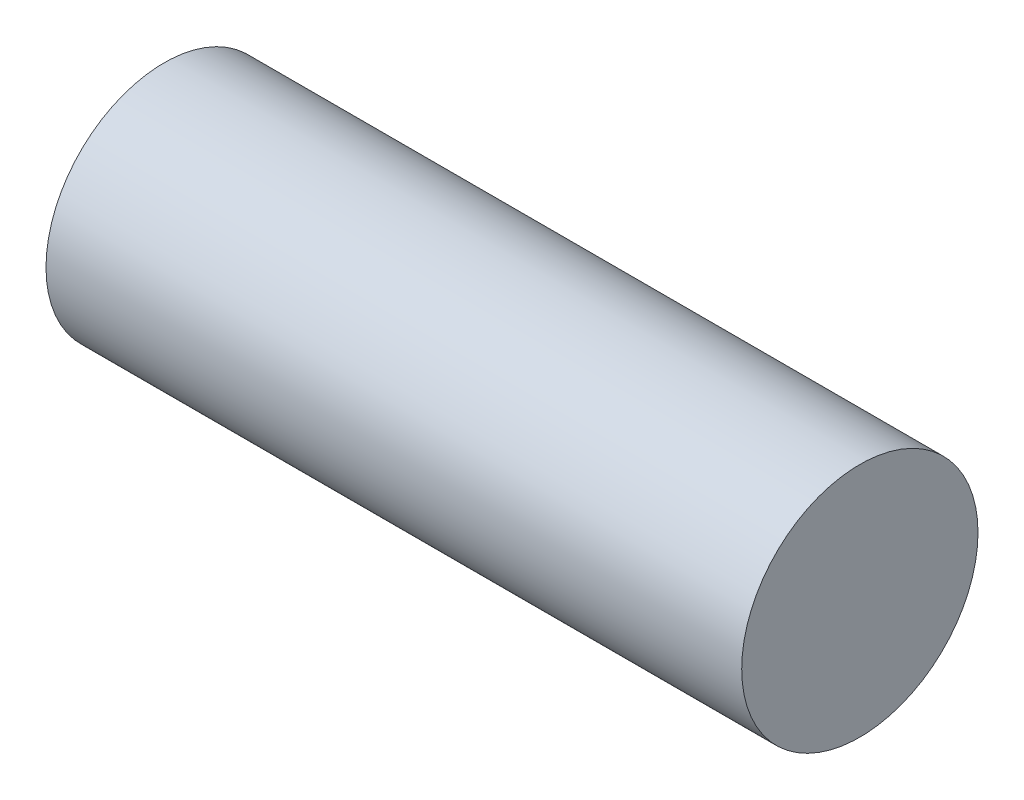
ISO-10303-21;
HEADER;
FILE_DESCRIPTION(('STEP AP214'),'2;1');
FILE_NAME('part.step','',(''),(''),'','','');
FILE_SCHEMA(('AUTOMOTIVE_DESIGN { 1 0 10303 214 1 1 1 1 }'));
ENDSEC;
DATA;
#1=APPLICATION_CONTEXT('core data for automotive mechanical design processes');
#2=APPLICATION_PROTOCOL_DEFINITION('international standard','automotive_design',2000,#1);
#3=PRODUCT_CONTEXT('',#1,'mechanical');
#4=PRODUCT('Part','Part','',(#3));
#5=PRODUCT_RELATED_PRODUCT_CATEGORY('part','',(#4));
#6=PRODUCT_DEFINITION_FORMATION('','',#4);
#7=PRODUCT_DEFINITION_CONTEXT('part definition',#1,'design');
#8=PRODUCT_DEFINITION('design','',#6,#7);
#9=PRODUCT_DEFINITION_SHAPE('','',#8);
#10=(LENGTH_UNIT() NAMED_UNIT(*) SI_UNIT(.MILLI.,.METRE.));
#11=(NAMED_UNIT(*) PLANE_ANGLE_UNIT() SI_UNIT($,.RADIAN.));
#12=(NAMED_UNIT(*) SI_UNIT($,.STERADIAN.) SOLID_ANGLE_UNIT());
#13=UNCERTAINTY_MEASURE_WITH_UNIT(LENGTH_MEASURE(1.E-05),#10,'distance_accuracy_value','');
#14=(GEOMETRIC_REPRESENTATION_CONTEXT(3) GLOBAL_UNCERTAINTY_ASSIGNED_CONTEXT((#13)) GLOBAL_UNIT_ASSIGNED_CONTEXT((#10,
#11,#12)) REPRESENTATION_CONTEXT('',''));
#15=CARTESIAN_POINT('',(0.,0.,0.));
#16=DIRECTION('',(0.,0.,1.));
#17=DIRECTION('',(1.,0.,0.));
#18=AXIS2_PLACEMENT_3D('',#15,#16,#17);
#19=CARTESIAN_POINT('',(203.841332811047,-1119.38419576661,1501.1949151545));
#20=DIRECTION('',(-1.,0.,0.));
#21=DIRECTION('',(0.,0.206340944429472,0.978480155471716));
#22=AXIS2_PLACEMENT_3D('',#19,#20,#21);
#23=PLANE('',#22);
#24=CARTESIAN_POINT('',(203.841332811047,-596.49215693489,1444.07159301595));
#25=DIRECTION('',(-1.,0.,0.));
#26=DIRECTION('',(0.,0.,1.));
#27=AXIS2_PLACEMENT_3D('',#24,#25,#26);
#28=CIRCLE('',#27,12.5672927184208);
#29=CARTESIAN_POINT('',(203.841332811047,-596.49215693489,1456.63888573437));
#30=VERTEX_POINT('',#29);
#31=EDGE_CURVE('E10',#30,#30,#28,.F.);
#32=ORIENTED_EDGE('',*,*,#31,.F.);
#33=EDGE_LOOP('',(#32));
#34=FACE_BOUND('',#33,.T.);
#35=ADVANCED_FACE('F32',(#34),#23,.T.);
#36=CARTESIAN_POINT('',(277.841332811047,-596.49215693489,1444.07159301595));
#37=DIRECTION('',(1.,0.,0.));
#38=DIRECTION('',(0.,0.,-1.));
#39=AXIS2_PLACEMENT_3D('',#36,#37,#38);
#40=PLANE('',#39);
#41=CARTESIAN_POINT('',(277.841332811047,-596.49215693489,1444.07159301595));
#42=DIRECTION('',(1.,0.,0.));
#43=DIRECTION('',(0.,0.,-1.));
#44=AXIS2_PLACEMENT_3D('',#41,#42,#43);
#45=CIRCLE('',#44,12.5672927184208);
#46=CARTESIAN_POINT('',(277.841332811047,-596.49215693489,1431.50430029753));
#47=VERTEX_POINT('',#46);
#48=EDGE_CURVE('E38',#47,#47,#45,.T.);
#49=ORIENTED_EDGE('',*,*,#48,.T.);
#50=EDGE_LOOP('',(#49));
#51=FACE_BOUND('',#50,.T.);
#52=ADVANCED_FACE('F44',(#51),#40,.T.);
#53=CARTESIAN_POINT('',(168.29566120164,-596.49215693489,1444.07159301595));
#54=DIRECTION('',(1.,0.,0.));
#55=DIRECTION('',(0.,0.,-1.));
#56=AXIS2_PLACEMENT_3D('',#53,#54,#55);
#57=CYLINDRICAL_SURFACE('',#56,12.5672927184208);
#58=ORIENTED_EDGE('',*,*,#48,.F.);
#59=EDGE_LOOP('',(#58));
#60=FACE_BOUND('',#59,.T.);
#61=ORIENTED_EDGE('',*,*,#31,.T.);
#62=EDGE_LOOP('',(#61));
#63=FACE_BOUND('',#62,.T.);
#64=ADVANCED_FACE('F46',(#60,#63),#57,.T.);
#65=CLOSED_SHELL('',(#35,#52,#64));
#66=MANIFOLD_SOLID_BREP('B2',#65);
#67=ADVANCED_BREP_SHAPE_REPRESENTATION('',(#18,#66),#14);
#68=SHAPE_DEFINITION_REPRESENTATION(#9,#67);
ENDSEC;
END-ISO-10303-21;
